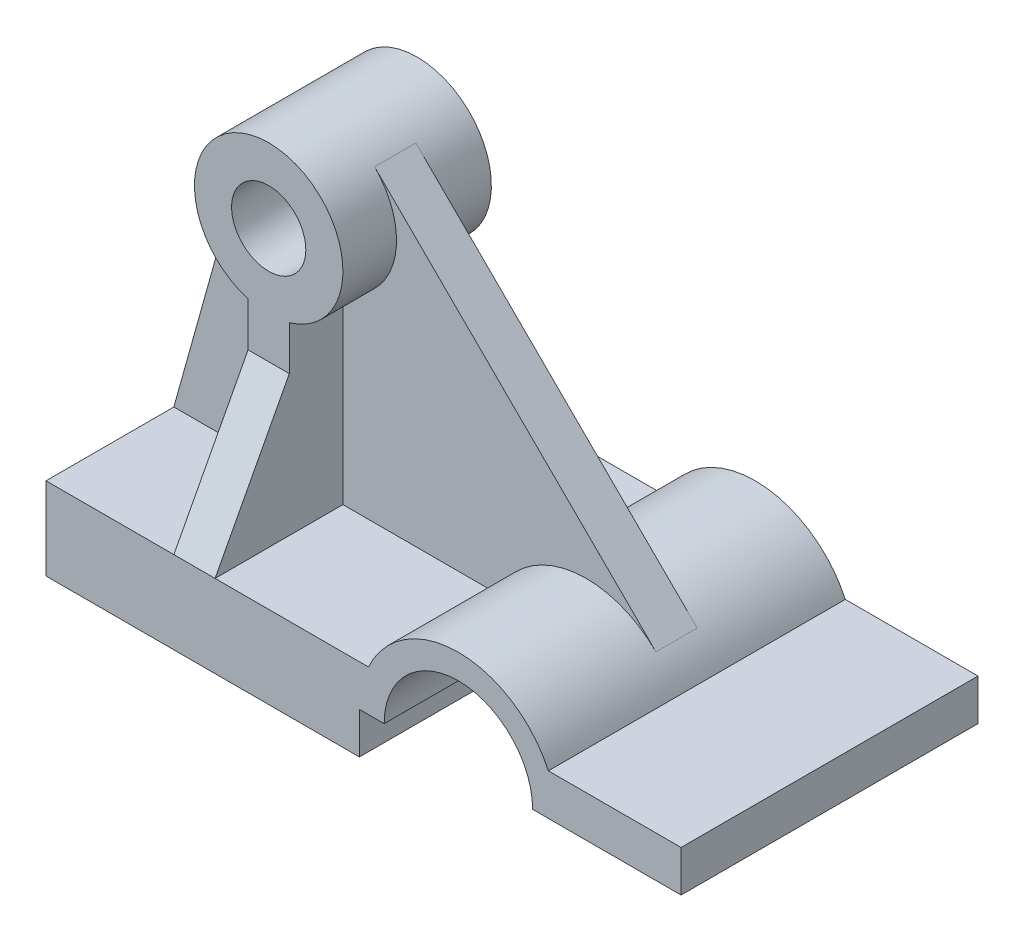
ISO-10303-21;
HEADER;
FILE_DESCRIPTION(('STEP AP214'),'2;1');
FILE_NAME('part.step','',(''),(''),'','','');
FILE_SCHEMA(('AUTOMOTIVE_DESIGN { 1 0 10303 214 1 1 1 1 }'));
ENDSEC;
DATA;
#1=APPLICATION_CONTEXT('core data for automotive mechanical design processes');
#2=APPLICATION_PROTOCOL_DEFINITION('international standard','automotive_design',2000,#1);
#3=PRODUCT_CONTEXT('',#1,'mechanical');
#4=PRODUCT('Part','Part','',(#3));
#5=PRODUCT_RELATED_PRODUCT_CATEGORY('part','',(#4));
#6=PRODUCT_DEFINITION_FORMATION('','',#4);
#7=PRODUCT_DEFINITION_CONTEXT('part definition',#1,'design');
#8=PRODUCT_DEFINITION('design','',#6,#7);
#9=PRODUCT_DEFINITION_SHAPE('','',#8);
#10=(LENGTH_UNIT() NAMED_UNIT(*) SI_UNIT(.MILLI.,.METRE.));
#11=(NAMED_UNIT(*) PLANE_ANGLE_UNIT() SI_UNIT($,.RADIAN.));
#12=(NAMED_UNIT(*) SI_UNIT($,.STERADIAN.) SOLID_ANGLE_UNIT());
#13=UNCERTAINTY_MEASURE_WITH_UNIT(LENGTH_MEASURE(1.E-05),#10,'distance_accuracy_value','');
#14=(GEOMETRIC_REPRESENTATION_CONTEXT(3) GLOBAL_UNCERTAINTY_ASSIGNED_CONTEXT((#13)) GLOBAL_UNIT_ASSIGNED_CONTEXT((#10,
#11,#12)) REPRESENTATION_CONTEXT('',''));
#15=CARTESIAN_POINT('',(0.,0.,0.));
#16=DIRECTION('',(0.,0.,1.));
#17=DIRECTION('',(1.,0.,0.));
#18=AXIS2_PLACEMENT_3D('',#15,#16,#17);
#19=CARTESIAN_POINT('',(36.9928651597961,18.1864951768489,-72.));
#20=DIRECTION('',(0.,1.,0.));
#21=DIRECTION('',(-1.,0.,0.));
#22=AXIS2_PLACEMENT_3D('',#19,#20,#21);
#23=PLANE('',#22);
#24=DIRECTION('',(0.,0.,1.));
#25=VECTOR('',#24,1.);
#26=CARTESIAN_POINT('',(-0.189710610932506,18.1864951768489,-98.));
#27=LINE('',#26,#25);
#28=CARTESIAN_POINT('',(-0.189710610932506,18.1864951768489,-31.));
#29=VERTEX_POINT('',#28);
#30=CARTESIAN_POINT('',(-0.189710610932495,18.1864951768489,0.));
#31=VERTEX_POINT('',#30);
#32=EDGE_CURVE('E81',#29,#31,#27,.T.);
#33=ORIENTED_EDGE('',*,*,#32,.T.);
#34=DIRECTION('',(-1.,0.,0.));
#35=VECTOR('',#34,1.);
#36=CARTESIAN_POINT('',(36.9928651597961,18.1864951768489,0.));
#37=LINE('',#36,#35);
#38=CARTESIAN_POINT('',(36.9928651597961,18.1864951768489,0.));
#39=VERTEX_POINT('',#38);
#40=EDGE_CURVE('E359',#39,#31,#37,.T.);
#41=ORIENTED_EDGE('',*,*,#40,.F.);
#42=DIRECTION('',(0.,0.,1.));
#43=VECTOR('',#42,1.);
#44=CARTESIAN_POINT('',(36.9928651597961,18.1864951768489,-72.));
#45=LINE('',#44,#43);
#46=CARTESIAN_POINT('',(36.9928651597961,18.1864951768489,-31.));
#47=VERTEX_POINT('',#46);
#48=EDGE_CURVE('E440',#47,#39,#45,.T.);
#49=ORIENTED_EDGE('',*,*,#48,.F.);
#50=DIRECTION('',(1.,0.,0.));
#51=VECTOR('',#50,1.);
#52=CARTESIAN_POINT('',(36.9928651597961,18.1864951768489,-31.));
#53=LINE('',#52,#51);
#54=EDGE_CURVE('E294',#29,#47,#53,.T.);
#55=ORIENTED_EDGE('',*,*,#54,.F.);
#56=EDGE_LOOP('',(#33,#41,#49,#55));
#57=FACE_BOUND('',#56,.T.);
#58=ADVANCED_FACE('F57',(#57),#23,.T.);
#59=DIRECTION('',(0.,0.,1.));
#60=VECTOR('',#59,1.);
#61=CARTESIAN_POINT('',(-10.1897106109325,18.1864951768489,-98.));
#62=LINE('',#61,#60);
#63=CARTESIAN_POINT('',(-10.1897106109325,18.1864951768489,-54.));
#64=VERTEX_POINT('',#63);
#65=CARTESIAN_POINT('',(-10.1897106109325,18.1864951768489,-41.));
#66=VERTEX_POINT('',#65);
#67=EDGE_CURVE('E317',#64,#66,#62,.T.);
#68=ORIENTED_EDGE('',*,*,#67,.F.);
#69=DIRECTION('',(-1.,0.,0.));
#70=VECTOR('',#69,1.);
#71=CARTESIAN_POINT('',(-23.1897106109325,18.1864951768489,-54.));
#72=LINE('',#71,#70);
#73=CARTESIAN_POINT('',(-0.189710610932506,18.1864951768489,-54.));
#74=VERTEX_POINT('',#73);
#75=EDGE_CURVE('E349',#74,#64,#72,.T.);
#76=ORIENTED_EDGE('',*,*,#75,.F.);
#77=CARTESIAN_POINT('',(-0.189710610932506,18.1864951768489,-41.));
#78=VERTEX_POINT('',#77);
#79=EDGE_CURVE('E310',#74,#78,#27,.T.);
#80=ORIENTED_EDGE('',*,*,#79,.T.);
#81=DIRECTION('',(1.,0.,0.));
#82=VECTOR('',#81,1.);
#83=CARTESIAN_POINT('',(36.9928651597961,18.1864951768489,-41.));
#84=LINE('',#83,#82);
#85=CARTESIAN_POINT('',(36.9928651597961,18.1864951768489,-41.));
#86=VERTEX_POINT('',#85);
#87=EDGE_CURVE('E280',#78,#86,#84,.T.);
#88=ORIENTED_EDGE('',*,*,#87,.T.);
#89=CARTESIAN_POINT('',(36.9928651597961,18.1864951768489,-72.));
#90=VERTEX_POINT('',#89);
#91=EDGE_CURVE('E436',#90,#86,#45,.T.);
#92=ORIENTED_EDGE('',*,*,#91,.F.);
#93=DIRECTION('',(-1.,0.,0.));
#94=VECTOR('',#93,1.);
#95=CARTESIAN_POINT('',(36.9928651597961,18.1864951768489,-72.));
#96=LINE('',#95,#94);
#97=CARTESIAN_POINT('',(-41.1897106109325,18.1864951768489,-72.));
#98=VERTEX_POINT('',#97);
#99=EDGE_CURVE('E390',#90,#98,#96,.T.);
#100=ORIENTED_EDGE('',*,*,#99,.T.);
#101=DIRECTION('',(0.,0.,1.));
#102=VECTOR('',#101,1.);
#103=CARTESIAN_POINT('',(-41.1897106109325,18.1864951768489,-72.));
#104=LINE('',#103,#102);
#105=CARTESIAN_POINT('',(-41.1897106109325,18.1864951768489,-41.));
#106=VERTEX_POINT('',#105);
#107=EDGE_CURVE('E431',#98,#106,#104,.T.);
#108=ORIENTED_EDGE('',*,*,#107,.T.);
#109=DIRECTION('',(1.,0.,0.));
#110=VECTOR('',#109,1.);
#111=CARTESIAN_POINT('',(36.9928651597961,18.1864951768489,-41.));
#112=LINE('',#111,#110);
#113=EDGE_CURVE('E237',#106,#66,#112,.T.);
#114=ORIENTED_EDGE('',*,*,#113,.T.);
#115=EDGE_LOOP('',(#68,#76,#80,#88,#92,#100,#108,#114));
#116=FACE_BOUND('',#115,.T.);
#117=ADVANCED_FACE('F521',(#116),#23,.T.);
#118=CARTESIAN_POINT('',(-10.1897106109325,0.,-98.));
#119=DIRECTION('',(-1.,0.,0.));
#120=DIRECTION('',(0.,0.,1.));
#121=AXIS2_PLACEMENT_3D('',#118,#119,#120);
#122=PLANE('',#121);
#123=ORIENTED_EDGE('',*,*,#67,.T.);
#124=DIRECTION('',(0.,1.,0.));
#125=VECTOR('',#124,1.);
#126=CARTESIAN_POINT('',(-10.1897106109325,0.,-41.));
#127=LINE('',#126,#125);
#128=CARTESIAN_POINT('',(-10.1897106109325,62.8948787110583,-41.));
#129=VERTEX_POINT('',#128);
#130=EDGE_CURVE('E247',#66,#129,#127,.T.);
#131=ORIENTED_EDGE('',*,*,#130,.T.);
#132=DIRECTION('',(0.,0.,1.));
#133=VECTOR('',#132,1.);
#134=CARTESIAN_POINT('',(-10.1897106109325,62.8948787110583,-98.));
#135=LINE('',#134,#133);
#136=CARTESIAN_POINT('',(-10.1897106109325,62.8948787110583,-54.));
#137=VERTEX_POINT('',#136);
#138=EDGE_CURVE('E244',#137,#129,#135,.T.);
#139=ORIENTED_EDGE('',*,*,#138,.F.);
#140=DIRECTION('',(0.,-1.,0.));
#141=VECTOR('',#140,1.);
#142=CARTESIAN_POINT('',(-10.1897106109325,98.1864951768489,-54.));
#143=LINE('',#142,#141);
#144=EDGE_CURVE('E335',#137,#64,#143,.T.);
#145=ORIENTED_EDGE('',*,*,#144,.T.);
#146=EDGE_LOOP('',(#123,#131,#139,#145));
#147=FACE_BOUND('',#146,.T.);
#148=ADVANCED_FACE('F525',(#147),#122,.T.);
#149=CARTESIAN_POINT('',(-0.189710610932506,0.,-98.));
#150=DIRECTION('',(1.,0.,0.));
#151=DIRECTION('',(0.,0.,-1.));
#152=AXIS2_PLACEMENT_3D('',#149,#150,#151);
#153=PLANE('',#152);
#154=DIRECTION('',(0.,0.,1.));
#155=VECTOR('',#154,1.);
#156=CARTESIAN_POINT('',(-0.189710610932506,62.8948787110583,-98.));
#157=LINE('',#156,#155);
#158=CARTESIAN_POINT('',(-0.189710610932506,62.8948787110583,-54.));
#159=VERTEX_POINT('',#158);
#160=CARTESIAN_POINT('',(-0.189710610932506,62.8948787110583,-41.));
#161=VERTEX_POINT('',#160);
#162=EDGE_CURVE('E328',#159,#161,#157,.T.);
#163=ORIENTED_EDGE('',*,*,#162,.T.);
#164=DIRECTION('',(0.,-1.,0.));
#165=VECTOR('',#164,1.);
#166=CARTESIAN_POINT('',(-0.189710610932506,0.,-41.));
#167=LINE('',#166,#165);
#168=EDGE_CURVE('E276',#161,#78,#167,.T.);
#169=ORIENTED_EDGE('',*,*,#168,.T.);
#170=ORIENTED_EDGE('',*,*,#79,.F.);
#171=DIRECTION('',(0.,1.,0.));
#172=VECTOR('',#171,1.);
#173=CARTESIAN_POINT('',(-0.189710610932505,98.1864951768489,-54.));
#174=LINE('',#173,#172);
#175=EDGE_CURVE('E315',#74,#159,#174,.T.);
#176=ORIENTED_EDGE('',*,*,#175,.T.);
#177=EDGE_LOOP('',(#163,#169,#170,#176));
#178=FACE_BOUND('',#177,.T.);
#179=ADVANCED_FACE('F531',(#178),#153,.T.);
#180=CARTESIAN_POINT('',(-23.1897106109325,98.1864951768489,-54.));
#181=DIRECTION('',(0.,0.,1.));
#182=DIRECTION('',(1.,0.,0.));
#183=AXIS2_PLACEMENT_3D('',#180,#181,#182);
#184=PLANE('',#183);
#185=CARTESIAN_POINT('',(-5.18971061093251,80.1864951768489,-54.));
#186=DIRECTION('',(0.,0.,1.));
#187=DIRECTION('',(1.,0.,0.));
#188=AXIS2_PLACEMENT_3D('',#185,#186,#187);
#189=CIRCLE('',#188,9.);
#190=CARTESIAN_POINT('',(3.81028938906749,80.1864951768489,-54.));
#191=VERTEX_POINT('',#190);
#192=EDGE_CURVE('E345',#191,#191,#189,.T.);
#193=ORIENTED_EDGE('',*,*,#192,.T.);
#194=EDGE_LOOP('',(#193));
#195=FACE_BOUND('',#194,.T.);
#196=ORIENTED_EDGE('',*,*,#144,.F.);
#197=CARTESIAN_POINT('',(-5.18971061093251,80.1864951768489,-54.));
#198=DIRECTION('',(0.,0.,1.));
#199=DIRECTION('',(1.,0.,0.));
#200=AXIS2_PLACEMENT_3D('',#197,#198,#199);
#201=CIRCLE('',#200,18.);
#202=EDGE_CURVE('E338',#159,#137,#201,.T.);
#203=ORIENTED_EDGE('',*,*,#202,.F.);
#204=ORIENTED_EDGE('',*,*,#175,.F.);
#205=ORIENTED_EDGE('',*,*,#75,.T.);
#206=EDGE_LOOP('',(#196,#203,#204,#205));
#207=FACE_BOUND('',#206,.T.);
#208=ADVANCED_FACE('F528',(#195,#207),#184,.F.);
#209=CARTESIAN_POINT('',(-23.1897106109325,98.1864951768489,-18.));
#210=DIRECTION('',(0.,0.,-1.));
#211=DIRECTION('',(-1.,0.,0.));
#212=AXIS2_PLACEMENT_3D('',#209,#210,#211);
#213=PLANE('',#212);
#214=CARTESIAN_POINT('',(-5.18971061093251,80.1864951768489,-18.));
#215=DIRECTION('',(0.,0.,1.));
#216=DIRECTION('',(1.,0.,0.));
#217=AXIS2_PLACEMENT_3D('',#214,#215,#216);
#218=CIRCLE('',#217,9.);
#219=CARTESIAN_POINT('',(3.81028938906749,80.1864951768489,-18.));
#220=VERTEX_POINT('',#219);
#221=EDGE_CURVE('E341',#220,#220,#218,.T.);
#222=ORIENTED_EDGE('',*,*,#221,.F.);
#223=EDGE_LOOP('',(#222));
#224=FACE_BOUND('',#223,.T.);
#225=DIRECTION('',(0.,-1.,0.));
#226=VECTOR('',#225,1.);
#227=CARTESIAN_POINT('',(-10.1897106109325,0.,-18.));
#228=LINE('',#227,#226);
#229=CARTESIAN_POINT('',(-10.1897106109325,62.8948787110583,-18.));
#230=VERTEX_POINT('',#229);
#231=CARTESIAN_POINT('',(-10.1897106109325,52.1864951768489,-18.));
#232=VERTEX_POINT('',#231);
#233=EDGE_CURVE('E309',#230,#232,#228,.T.);
#234=ORIENTED_EDGE('',*,*,#233,.T.);
#235=DIRECTION('',(-1.,0.,0.));
#236=VECTOR('',#235,1.);
#237=CARTESIAN_POINT('',(-23.1897106109325,52.1864951768489,-18.));
#238=LINE('',#237,#236);
#239=CARTESIAN_POINT('',(-0.189710610932499,52.1864951768489,-18.));
#240=VERTEX_POINT('',#239);
#241=EDGE_CURVE('E239',#232,#240,#238,.F.);
#242=ORIENTED_EDGE('',*,*,#241,.T.);
#243=DIRECTION('',(0.,1.,0.));
#244=VECTOR('',#243,1.);
#245=CARTESIAN_POINT('',(-0.189710610932506,0.,-18.));
#246=LINE('',#245,#244);
#247=CARTESIAN_POINT('',(-0.189710610932505,62.8948787110583,-18.));
#248=VERTEX_POINT('',#247);
#249=EDGE_CURVE('E304',#240,#248,#246,.T.);
#250=ORIENTED_EDGE('',*,*,#249,.T.);
#251=CARTESIAN_POINT('',(-5.18971061093251,80.1864951768489,-18.));
#252=DIRECTION('',(0.,0.,1.));
#253=DIRECTION('',(1.,0.,0.));
#254=AXIS2_PLACEMENT_3D('',#251,#252,#253);
#255=CIRCLE('',#254,18.);
#256=EDGE_CURVE('E305',#248,#230,#255,.T.);
#257=ORIENTED_EDGE('',*,*,#256,.T.);
#258=EDGE_LOOP('',(#234,#242,#250,#257));
#259=FACE_BOUND('',#258,.T.);
#260=ADVANCED_FACE('F574',(#224,#259),#213,.F.);
#261=CARTESIAN_POINT('',(-10.1897106109325,18.1864951768489,0.));
#262=VERTEX_POINT('',#261);
#263=CARTESIAN_POINT('',(-41.1897106109325,18.1864951768489,0.));
#264=VERTEX_POINT('',#263);
#265=EDGE_CURVE('E428',#262,#264,#37,.T.);
#266=ORIENTED_EDGE('',*,*,#265,.F.);
#267=CARTESIAN_POINT('',(-10.1897106109325,18.1864951768489,-31.));
#268=VERTEX_POINT('',#267);
#269=EDGE_CURVE('E73',#268,#262,#62,.T.);
#270=ORIENTED_EDGE('',*,*,#269,.F.);
#271=DIRECTION('',(1.,0.,0.));
#272=VECTOR('',#271,1.);
#273=CARTESIAN_POINT('',(36.9928651597961,18.1864951768489,-31.));
#274=LINE('',#273,#272);
#275=CARTESIAN_POINT('',(-41.1897106109325,18.1864951768489,-31.));
#276=VERTEX_POINT('',#275);
#277=EDGE_CURVE('E258',#276,#268,#274,.T.);
#278=ORIENTED_EDGE('',*,*,#277,.F.);
#279=EDGE_CURVE('E435',#276,#264,#104,.T.);
#280=ORIENTED_EDGE('',*,*,#279,.T.);
#281=EDGE_LOOP('',(#266,#270,#278,#280));
#282=FACE_BOUND('',#281,.T.);
#283=ADVANCED_FACE('F491',(#282),#23,.T.);
#284=CARTESIAN_POINT('',(-41.1897106109325,18.1864951768489,-72.));
#285=DIRECTION('',(-1.,0.,0.));
#286=DIRECTION('',(0.,0.,1.));
#287=AXIS2_PLACEMENT_3D('',#284,#285,#286);
#288=PLANE('',#287);
#289=ORIENTED_EDGE('',*,*,#279,.F.);
#290=DIRECTION('',(0.,0.,-1.));
#291=VECTOR('',#290,1.);
#292=CARTESIAN_POINT('',(-41.1897106109325,18.1864951768489,-72.));
#293=LINE('',#292,#291);
#294=EDGE_CURVE('E261',#276,#106,#293,.T.);
#295=ORIENTED_EDGE('',*,*,#294,.T.);
#296=ORIENTED_EDGE('',*,*,#107,.F.);
#297=DIRECTION('',(0.,-1.,0.));
#298=VECTOR('',#297,1.);
#299=CARTESIAN_POINT('',(-41.1897106109325,18.1864951768489,-72.));
#300=LINE('',#299,#298);
#301=CARTESIAN_POINT('',(-41.1897106109325,-1.81350482315113,-72.));
#302=VERTEX_POINT('',#301);
#303=EDGE_CURVE('E354',#98,#302,#300,.T.);
#304=ORIENTED_EDGE('',*,*,#303,.T.);
#305=DIRECTION('',(0.,0.,1.));
#306=VECTOR('',#305,1.);
#307=CARTESIAN_POINT('',(-41.1897106109325,-1.81350482315113,-72.));
#308=LINE('',#307,#306);
#309=CARTESIAN_POINT('',(-41.1897106109325,-1.81350482315113,0.));
#310=VERTEX_POINT('',#309);
#311=EDGE_CURVE('E393',#302,#310,#308,.T.);
#312=ORIENTED_EDGE('',*,*,#311,.T.);
#313=DIRECTION('',(0.,-1.,0.));
#314=VECTOR('',#313,1.);
#315=CARTESIAN_POINT('',(-41.1897106109325,18.1864951768489,0.));
#316=LINE('',#315,#314);
#317=EDGE_CURVE('E353',#264,#310,#316,.T.);
#318=ORIENTED_EDGE('',*,*,#317,.F.);
#319=EDGE_LOOP('',(#289,#295,#296,#304,#312,#318));
#320=FACE_BOUND('',#319,.T.);
#321=ADVANCED_FACE('F59',(#320),#288,.T.);
#322=CARTESIAN_POINT('',(58.8102893890675,8.18649517684887,-72.));
#323=DIRECTION('',(0.,0.,1.));
#324=DIRECTION('',(1.,0.,0.));
#325=AXIS2_PLACEMENT_3D('',#322,#323,#324);
#326=CYLINDRICAL_SURFACE('',#325,24.);
#327=CARTESIAN_POINT('',(58.8102893890675,8.18649517684887,0.));
#328=DIRECTION('',(0.,0.,1.));
#329=DIRECTION('',(1.,0.,0.));
#330=AXIS2_PLACEMENT_3D('',#327,#328,#329);
#331=CIRCLE('',#330,24.);
#332=CARTESIAN_POINT('',(80.6277136183389,18.1864951768489,0.));
#333=VERTEX_POINT('',#332);
#334=EDGE_CURVE('E424',#333,#39,#331,.T.);
#335=ORIENTED_EDGE('',*,*,#334,.F.);
#336=DIRECTION('',(0.,0.,1.));
#337=VECTOR('',#336,1.);
#338=CARTESIAN_POINT('',(80.6277136183389,18.1864951768489,-72.));
#339=LINE('',#338,#337);
#340=CARTESIAN_POINT('',(80.6277136183389,18.1864951768489,-72.));
#341=VERTEX_POINT('',#340);
#342=EDGE_CURVE('E441',#341,#333,#339,.T.);
#343=ORIENTED_EDGE('',*,*,#342,.F.);
#344=CARTESIAN_POINT('',(58.8102893890675,8.18649517684887,-72.));
#345=DIRECTION('',(0.,0.,1.));
#346=DIRECTION('',(1.,0.,0.));
#347=AXIS2_PLACEMENT_3D('',#344,#345,#346);
#348=CIRCLE('',#347,24.);
#349=EDGE_CURVE('E386',#341,#90,#348,.T.);
#350=ORIENTED_EDGE('',*,*,#349,.T.);
#351=ORIENTED_EDGE('',*,*,#91,.T.);
#352=CARTESIAN_POINT('',(58.8102893890675,8.18649517684887,-41.));
#353=DIRECTION('',(0.,0.,1.));
#354=DIRECTION('',(1.,0.,0.));
#355=AXIS2_PLACEMENT_3D('',#352,#353,#354);
#356=CIRCLE('',#355,24.);
#357=CARTESIAN_POINT('',(75.7201825877705,25.2175113534738,-41.));
#358=VERTEX_POINT('',#357);
#359=EDGE_CURVE('E284',#86,#358,#356,.F.);
#360=ORIENTED_EDGE('',*,*,#359,.T.);
#361=DIRECTION('',(0.,0.,1.));
#362=VECTOR('',#361,1.);
#363=CARTESIAN_POINT('',(75.7201825877705,25.2175113534738,-72.));
#364=LINE('',#363,#362);
#365=CARTESIAN_POINT('',(75.7201825877705,25.2175113534738,-31.));
#366=VERTEX_POINT('',#365);
#367=EDGE_CURVE('E300',#358,#366,#364,.T.);
#368=ORIENTED_EDGE('',*,*,#367,.T.);
#369=CARTESIAN_POINT('',(58.8102893890675,8.18649517684887,-31.));
#370=DIRECTION('',(0.,0.,1.));
#371=DIRECTION('',(1.,0.,0.));
#372=AXIS2_PLACEMENT_3D('',#369,#370,#371);
#373=CIRCLE('',#372,24.);
#374=EDGE_CURVE('E297',#47,#366,#373,.F.);
#375=ORIENTED_EDGE('',*,*,#374,.F.);
#376=ORIENTED_EDGE('',*,*,#48,.T.);
#377=EDGE_LOOP('',(#335,#343,#350,#351,#360,#368,#375,#376));
#378=FACE_BOUND('',#377,.T.);
#379=ADVANCED_FACE('F537',(#378),#326,.T.);
#380=CARTESIAN_POINT('',(112.810289389068,18.1864951768489,-72.));
#381=DIRECTION('',(0.,1.,0.));
#382=DIRECTION('',(-1.,0.,0.));
#383=AXIS2_PLACEMENT_3D('',#380,#381,#382);
#384=PLANE('',#383);
#385=DIRECTION('',(-1.,0.,0.));
#386=VECTOR('',#385,1.);
#387=CARTESIAN_POINT('',(112.810289389068,18.1864951768489,0.));
#388=LINE('',#387,#386);
#389=CARTESIAN_POINT('',(112.810289389068,18.1864951768489,0.));
#390=VERTEX_POINT('',#389);
#391=EDGE_CURVE('E420',#390,#333,#388,.T.);
#392=ORIENTED_EDGE('',*,*,#391,.F.);
#393=DIRECTION('',(0.,0.,1.));
#394=VECTOR('',#393,1.);
#395=CARTESIAN_POINT('',(112.810289389068,18.1864951768489,-72.));
#396=LINE('',#395,#394);
#397=CARTESIAN_POINT('',(112.810289389068,18.1864951768489,-72.));
#398=VERTEX_POINT('',#397);
#399=EDGE_CURVE('E444',#398,#390,#396,.T.);
#400=ORIENTED_EDGE('',*,*,#399,.F.);
#401=DIRECTION('',(-1.,0.,0.));
#402=VECTOR('',#401,1.);
#403=CARTESIAN_POINT('',(112.810289389068,18.1864951768489,-72.));
#404=LINE('',#403,#402);
#405=EDGE_CURVE('E382',#398,#341,#404,.T.);
#406=ORIENTED_EDGE('',*,*,#405,.T.);
#407=ORIENTED_EDGE('',*,*,#342,.T.);
#408=EDGE_LOOP('',(#392,#400,#406,#407));
#409=FACE_BOUND('',#408,.T.);
#410=ADVANCED_FACE('F570',(#409),#384,.T.);
#411=CARTESIAN_POINT('',(112.810289389068,8.18649517684887,-72.));
#412=DIRECTION('',(1.,0.,0.));
#413=DIRECTION('',(0.,0.,-1.));
#414=AXIS2_PLACEMENT_3D('',#411,#412,#413);
#415=PLANE('',#414);
#416=DIRECTION('',(0.,1.,0.));
#417=VECTOR('',#416,1.);
#418=CARTESIAN_POINT('',(112.810289389068,8.18649517684887,0.));
#419=LINE('',#418,#417);
#420=CARTESIAN_POINT('',(112.810289389068,8.18649517684887,0.));
#421=VERTEX_POINT('',#420);
#422=EDGE_CURVE('E416',#421,#390,#419,.T.);
#423=ORIENTED_EDGE('',*,*,#422,.F.);
#424=DIRECTION('',(0.,0.,1.));
#425=VECTOR('',#424,1.);
#426=CARTESIAN_POINT('',(112.810289389068,8.18649517684887,-72.));
#427=LINE('',#426,#425);
#428=CARTESIAN_POINT('',(112.810289389068,8.18649517684887,-72.));
#429=VERTEX_POINT('',#428);
#430=EDGE_CURVE('E447',#429,#421,#427,.T.);
#431=ORIENTED_EDGE('',*,*,#430,.F.);
#432=DIRECTION('',(0.,1.,0.));
#433=VECTOR('',#432,1.);
#434=CARTESIAN_POINT('',(112.810289389068,8.18649517684887,-72.));
#435=LINE('',#434,#433);
#436=EDGE_CURVE('E378',#429,#398,#435,.T.);
#437=ORIENTED_EDGE('',*,*,#436,.T.);
#438=ORIENTED_EDGE('',*,*,#399,.T.);
#439=EDGE_LOOP('',(#423,#431,#437,#438));
#440=FACE_BOUND('',#439,.T.);
#441=ADVANCED_FACE('F566',(#440),#415,.T.);
#442=CARTESIAN_POINT('',(76.8102893890675,8.18649517684887,-72.));
#443=DIRECTION('',(0.,-1.,0.));
#444=DIRECTION('',(0.,0.,-1.));
#445=AXIS2_PLACEMENT_3D('',#442,#443,#444);
#446=PLANE('',#445);
#447=DIRECTION('',(1.,0.,0.));
#448=VECTOR('',#447,1.);
#449=CARTESIAN_POINT('',(76.8102893890675,8.18649517684887,0.));
#450=LINE('',#449,#448);
#451=CARTESIAN_POINT('',(76.8102893890675,8.18649517684887,0.));
#452=VERTEX_POINT('',#451);
#453=EDGE_CURVE('E412',#452,#421,#450,.T.);
#454=ORIENTED_EDGE('',*,*,#453,.F.);
#455=DIRECTION('',(0.,0.,1.));
#456=VECTOR('',#455,1.);
#457=CARTESIAN_POINT('',(76.8102893890675,8.18649517684887,-72.));
#458=LINE('',#457,#456);
#459=CARTESIAN_POINT('',(76.8102893890675,8.18649517684887,-72.));
#460=VERTEX_POINT('',#459);
#461=EDGE_CURVE('E450',#460,#452,#458,.T.);
#462=ORIENTED_EDGE('',*,*,#461,.F.);
#463=DIRECTION('',(1.,0.,0.));
#464=VECTOR('',#463,1.);
#465=CARTESIAN_POINT('',(76.8102893890675,8.18649517684887,-72.));
#466=LINE('',#465,#464);
#467=EDGE_CURVE('E374',#460,#429,#466,.T.);
#468=ORIENTED_EDGE('',*,*,#467,.T.);
#469=ORIENTED_EDGE('',*,*,#430,.T.);
#470=EDGE_LOOP('',(#454,#462,#468,#469));
#471=FACE_BOUND('',#470,.T.);
#472=ADVANCED_FACE('F562',(#471),#446,.T.);
#473=CARTESIAN_POINT('',(58.8102893890675,8.18649517684887,-72.));
#474=DIRECTION('',(0.,0.,1.));
#475=DIRECTION('',(1.,0.,0.));
#476=AXIS2_PLACEMENT_3D('',#473,#474,#475);
#477=CYLINDRICAL_SURFACE('',#476,18.);
#478=CARTESIAN_POINT('',(58.8102893890675,8.18649517684887,0.));
#479=DIRECTION('',(0.,0.,-1.));
#480=DIRECTION('',(-1.,0.,0.));
#481=AXIS2_PLACEMENT_3D('',#478,#479,#480);
#482=CIRCLE('',#481,18.);
#483=CARTESIAN_POINT('',(40.8102893890675,8.18649517684887,0.));
#484=VERTEX_POINT('',#483);
#485=EDGE_CURVE('E408',#484,#452,#482,.T.);
#486=ORIENTED_EDGE('',*,*,#485,.F.);
#487=DIRECTION('',(0.,0.,1.));
#488=VECTOR('',#487,1.);
#489=CARTESIAN_POINT('',(40.8102893890675,8.18649517684887,-72.));
#490=LINE('',#489,#488);
#491=CARTESIAN_POINT('',(40.8102893890675,8.18649517684887,-72.));
#492=VERTEX_POINT('',#491);
#493=EDGE_CURVE('E453',#492,#484,#490,.T.);
#494=ORIENTED_EDGE('',*,*,#493,.F.);
#495=CARTESIAN_POINT('',(58.8102893890675,8.18649517684887,-72.));
#496=DIRECTION('',(0.,0.,-1.));
#497=DIRECTION('',(-1.,0.,0.));
#498=AXIS2_PLACEMENT_3D('',#495,#496,#497);
#499=CIRCLE('',#498,18.);
#500=EDGE_CURVE('E370',#492,#460,#499,.T.);
#501=ORIENTED_EDGE('',*,*,#500,.T.);
#502=ORIENTED_EDGE('',*,*,#461,.T.);
#503=EDGE_LOOP('',(#486,#494,#501,#502));
#504=FACE_BOUND('',#503,.T.);
#505=ADVANCED_FACE('F558',(#504),#477,.F.);
#506=CARTESIAN_POINT('',(34.8102893890675,8.18649517684887,-72.));
#507=DIRECTION('',(0.,-1.,0.));
#508=DIRECTION('',(1.,0.,0.));
#509=AXIS2_PLACEMENT_3D('',#506,#507,#508);
#510=PLANE('',#509);
#511=DIRECTION('',(1.,0.,0.));
#512=VECTOR('',#511,1.);
#513=CARTESIAN_POINT('',(34.8102893890675,8.18649517684887,0.));
#514=LINE('',#513,#512);
#515=CARTESIAN_POINT('',(34.8102893890675,8.18649517684887,0.));
#516=VERTEX_POINT('',#515);
#517=EDGE_CURVE('E404',#516,#484,#514,.T.);
#518=ORIENTED_EDGE('',*,*,#517,.F.);
#519=DIRECTION('',(0.,0.,1.));
#520=VECTOR('',#519,1.);
#521=CARTESIAN_POINT('',(34.8102893890675,8.18649517684887,-72.));
#522=LINE('',#521,#520);
#523=CARTESIAN_POINT('',(34.8102893890675,8.18649517684887,-72.));
#524=VERTEX_POINT('',#523);
#525=EDGE_CURVE('E456',#524,#516,#522,.T.);
#526=ORIENTED_EDGE('',*,*,#525,.F.);
#527=DIRECTION('',(1.,0.,0.));
#528=VECTOR('',#527,1.);
#529=CARTESIAN_POINT('',(34.8102893890675,8.18649517684887,-72.));
#530=LINE('',#529,#528);
#531=EDGE_CURVE('E366',#524,#492,#530,.T.);
#532=ORIENTED_EDGE('',*,*,#531,.T.);
#533=ORIENTED_EDGE('',*,*,#493,.T.);
#534=EDGE_LOOP('',(#518,#526,#532,#533));
#535=FACE_BOUND('',#534,.T.);
#536=ADVANCED_FACE('F555',(#535),#510,.T.);
#537=CARTESIAN_POINT('',(34.8102893890675,-1.81350482315113,-72.));
#538=DIRECTION('',(1.,0.,0.));
#539=DIRECTION('',(0.,0.,-1.));
#540=AXIS2_PLACEMENT_3D('',#537,#538,#539);
#541=PLANE('',#540);
#542=DIRECTION('',(0.,1.,0.));
#543=VECTOR('',#542,1.);
#544=CARTESIAN_POINT('',(34.8102893890675,-1.81350482315113,0.));
#545=LINE('',#544,#543);
#546=CARTESIAN_POINT('',(34.8102893890675,-1.81350482315113,0.));
#547=VERTEX_POINT('',#546);
#548=EDGE_CURVE('E400',#547,#516,#545,.T.);
#549=ORIENTED_EDGE('',*,*,#548,.F.);
#550=DIRECTION('',(0.,0.,1.));
#551=VECTOR('',#550,1.);
#552=CARTESIAN_POINT('',(34.8102893890675,-1.81350482315113,-72.));
#553=LINE('',#552,#551);
#554=CARTESIAN_POINT('',(34.8102893890675,-1.81350482315113,-72.));
#555=VERTEX_POINT('',#554);
#556=EDGE_CURVE('E459',#555,#547,#553,.T.);
#557=ORIENTED_EDGE('',*,*,#556,.F.);
#558=DIRECTION('',(0.,1.,0.));
#559=VECTOR('',#558,1.);
#560=CARTESIAN_POINT('',(34.8102893890675,-1.81350482315113,-72.));
#561=LINE('',#560,#559);
#562=EDGE_CURVE('E362',#555,#524,#561,.T.);
#563=ORIENTED_EDGE('',*,*,#562,.T.);
#564=ORIENTED_EDGE('',*,*,#525,.T.);
#565=EDGE_LOOP('',(#549,#557,#563,#564));
#566=FACE_BOUND('',#565,.T.);
#567=ADVANCED_FACE('F551',(#566),#541,.T.);
#568=CARTESIAN_POINT('',(-41.1897106109325,-1.81350482315113,-72.));
#569=DIRECTION('',(0.,-1.,0.));
#570=DIRECTION('',(0.,0.,-1.));
#571=AXIS2_PLACEMENT_3D('',#568,#569,#570);
#572=PLANE('',#571);
#573=DIRECTION('',(1.,0.,0.));
#574=VECTOR('',#573,1.);
#575=CARTESIAN_POINT('',(-41.1897106109325,-1.81350482315113,-72.));
#576=LINE('',#575,#574);
#577=EDGE_CURVE('E358',#302,#555,#576,.T.);
#578=ORIENTED_EDGE('',*,*,#577,.T.);
#579=ORIENTED_EDGE('',*,*,#556,.T.);
#580=DIRECTION('',(1.,0.,0.));
#581=VECTOR('',#580,1.);
#582=CARTESIAN_POINT('',(-41.1897106109325,-1.81350482315113,0.));
#583=LINE('',#582,#581);
#584=EDGE_CURVE('E397',#310,#547,#583,.T.);
#585=ORIENTED_EDGE('',*,*,#584,.F.);
#586=ORIENTED_EDGE('',*,*,#311,.F.);
#587=EDGE_LOOP('',(#578,#579,#585,#586));
#588=FACE_BOUND('',#587,.T.);
#589=ADVANCED_FACE('F548',(#588),#572,.T.);
#590=CARTESIAN_POINT('',(58.8102893890675,8.18649517684887,-72.));
#591=DIRECTION('',(0.,0.,-1.));
#592=DIRECTION('',(-1.,0.,0.));
#593=AXIS2_PLACEMENT_3D('',#590,#591,#592);
#594=PLANE('',#593);
#595=ORIENTED_EDGE('',*,*,#303,.F.);
#596=ORIENTED_EDGE('',*,*,#99,.F.);
#597=ORIENTED_EDGE('',*,*,#349,.F.);
#598=ORIENTED_EDGE('',*,*,#405,.F.);
#599=ORIENTED_EDGE('',*,*,#436,.F.);
#600=ORIENTED_EDGE('',*,*,#467,.F.);
#601=ORIENTED_EDGE('',*,*,#500,.F.);
#602=ORIENTED_EDGE('',*,*,#531,.F.);
#603=ORIENTED_EDGE('',*,*,#562,.F.);
#604=ORIENTED_EDGE('',*,*,#577,.F.);
#605=EDGE_LOOP('',(#595,#596,#597,#598,#599,#600,#601,#602,#603,#604));
#606=FACE_BOUND('',#605,.T.);
#607=ADVANCED_FACE('F543',(#606),#594,.T.);
#608=CARTESIAN_POINT('',(58.8102893890675,8.18649517684887,0.));
#609=DIRECTION('',(0.,0.,-1.));
#610=DIRECTION('',(-1.,0.,0.));
#611=AXIS2_PLACEMENT_3D('',#608,#609,#610);
#612=PLANE('',#611);
#613=ORIENTED_EDGE('',*,*,#584,.T.);
#614=ORIENTED_EDGE('',*,*,#548,.T.);
#615=ORIENTED_EDGE('',*,*,#517,.T.);
#616=ORIENTED_EDGE('',*,*,#485,.T.);
#617=ORIENTED_EDGE('',*,*,#453,.T.);
#618=ORIENTED_EDGE('',*,*,#422,.T.);
#619=ORIENTED_EDGE('',*,*,#391,.T.);
#620=ORIENTED_EDGE('',*,*,#334,.T.);
#621=ORIENTED_EDGE('',*,*,#40,.T.);
#622=DIRECTION('',(-1.,0.,0.));
#623=VECTOR('',#622,1.);
#624=CARTESIAN_POINT('',(58.8102893890675,18.1864951768489,0.));
#625=LINE('',#624,#623);
#626=EDGE_CURVE('E498',#262,#31,#625,.F.);
#627=ORIENTED_EDGE('',*,*,#626,.F.);
#628=ORIENTED_EDGE('',*,*,#265,.T.);
#629=ORIENTED_EDGE('',*,*,#317,.T.);
#630=EDGE_LOOP('',(#613,#614,#615,#616,#617,#618,#619,#620,#621,#627,#628,#629));
#631=FACE_BOUND('',#630,.T.);
#632=ADVANCED_FACE('F496',(#631),#612,.F.);
#633=CARTESIAN_POINT('',(-5.18971061093251,80.1864951768489,-98.));
#634=DIRECTION('',(0.,0.,1.));
#635=DIRECTION('',(1.,0.,0.));
#636=AXIS2_PLACEMENT_3D('',#633,#634,#635);
#637=CYLINDRICAL_SURFACE('',#636,9.);
#638=ORIENTED_EDGE('',*,*,#192,.F.);
#639=EDGE_LOOP('',(#638));
#640=FACE_BOUND('',#639,.T.);
#641=ORIENTED_EDGE('',*,*,#221,.T.);
#642=EDGE_LOOP('',(#641));
#643=FACE_BOUND('',#642,.T.);
#644=ADVANCED_FACE('F609',(#640,#643),#637,.F.);
#645=ORIENTED_EDGE('',*,*,#249,.F.);
#646=DIRECTION('',(0.,-0.883787916347062,0.467887720419033));
#647=VECTOR('',#646,1.);
#648=CARTESIAN_POINT('',(-0.189710610932492,52.1864951768489,-18.));
#649=LINE('',#648,#647);
#650=EDGE_CURVE('E510',#240,#31,#649,.T.);
#651=ORIENTED_EDGE('',*,*,#650,.T.);
#652=ORIENTED_EDGE('',*,*,#32,.F.);
#653=DIRECTION('',(0.,-1.,0.));
#654=VECTOR('',#653,1.);
#655=CARTESIAN_POINT('',(-0.189710610932506,0.,-31.));
#656=LINE('',#655,#654);
#657=CARTESIAN_POINT('',(-0.189710610932507,62.8948787110583,-31.));
#658=VERTEX_POINT('',#657);
#659=EDGE_CURVE('E291',#658,#29,#656,.T.);
#660=ORIENTED_EDGE('',*,*,#659,.F.);
#661=EDGE_CURVE('E324',#658,#248,#157,.T.);
#662=ORIENTED_EDGE('',*,*,#661,.T.);
#663=EDGE_LOOP('',(#645,#651,#652,#660,#662));
#664=FACE_BOUND('',#663,.T.);
#665=ADVANCED_FACE('F572',(#664),#153,.T.);
#666=CARTESIAN_POINT('',(-5.18971061093251,80.1864951768489,-98.));
#667=DIRECTION('',(0.,0.,1.));
#668=DIRECTION('',(1.,0.,0.));
#669=AXIS2_PLACEMENT_3D('',#666,#667,#668);
#670=CYLINDRICAL_SURFACE('',#669,18.);
#671=ORIENTED_EDGE('',*,*,#202,.T.);
#672=ORIENTED_EDGE('',*,*,#138,.T.);
#673=CARTESIAN_POINT('',(-5.18971061093251,80.1864951768489,-41.));
#674=DIRECTION('',(0.,0.,1.));
#675=DIRECTION('',(1.,0.,0.));
#676=AXIS2_PLACEMENT_3D('',#673,#674,#675);
#677=CIRCLE('',#676,18.);
#678=CARTESIAN_POINT('',(-22.5265793699625,85.0272576820921,-41.));
#679=VERTEX_POINT('',#678);
#680=EDGE_CURVE('E234',#129,#679,#677,.F.);
#681=ORIENTED_EDGE('',*,*,#680,.T.);
#682=DIRECTION('',(0.,0.,1.));
#683=VECTOR('',#682,1.);
#684=CARTESIAN_POINT('',(-22.5265793699625,85.0272576820921,-98.));
#685=LINE('',#684,#683);
#686=CARTESIAN_POINT('',(-22.5265793699625,85.0272576820921,-31.));
#687=VERTEX_POINT('',#686);
#688=EDGE_CURVE('E12',#687,#679,#685,.F.);
#689=ORIENTED_EDGE('',*,*,#688,.F.);
#690=CARTESIAN_POINT('',(-5.18971061093251,80.1864951768489,-31.));
#691=DIRECTION('',(0.,0.,1.));
#692=DIRECTION('',(1.,0.,0.));
#693=AXIS2_PLACEMENT_3D('',#690,#691,#692);
#694=CIRCLE('',#693,18.);
#695=CARTESIAN_POINT('',(-10.1897106109325,62.8948787110583,-31.));
#696=VERTEX_POINT('',#695);
#697=EDGE_CURVE('E246',#696,#687,#694,.F.);
#698=ORIENTED_EDGE('',*,*,#697,.F.);
#699=EDGE_CURVE('E316',#696,#230,#135,.T.);
#700=ORIENTED_EDGE('',*,*,#699,.T.);
#701=ORIENTED_EDGE('',*,*,#256,.F.);
#702=ORIENTED_EDGE('',*,*,#661,.F.);
#703=CARTESIAN_POINT('',(-5.18971061093251,80.1864951768489,-31.));
#704=DIRECTION('',(0.,0.,1.));
#705=DIRECTION('',(1.,0.,0.));
#706=AXIS2_PLACEMENT_3D('',#703,#704,#705);
#707=CIRCLE('',#706,18.);
#708=CARTESIAN_POINT('',(7.49270928809474,92.9597573093175,-31.));
#709=VERTEX_POINT('',#708);
#710=EDGE_CURVE('E288',#709,#658,#707,.F.);
#711=ORIENTED_EDGE('',*,*,#710,.F.);
#712=DIRECTION('',(0.,0.,1.));
#713=VECTOR('',#712,1.);
#714=CARTESIAN_POINT('',(7.49270928809474,92.9597573093175,-98.));
#715=LINE('',#714,#713);
#716=CARTESIAN_POINT('',(7.49270928809474,92.9597573093175,-41.));
#717=VERTEX_POINT('',#716);
#718=EDGE_CURVE('E66',#717,#709,#715,.T.);
#719=ORIENTED_EDGE('',*,*,#718,.F.);
#720=CARTESIAN_POINT('',(-5.18971061093251,80.1864951768489,-41.));
#721=DIRECTION('',(0.,0.,1.));
#722=DIRECTION('',(1.,0.,0.));
#723=AXIS2_PLACEMENT_3D('',#720,#721,#722);
#724=CIRCLE('',#723,18.);
#725=EDGE_CURVE('E269',#717,#161,#724,.F.);
#726=ORIENTED_EDGE('',*,*,#725,.T.);
#727=ORIENTED_EDGE('',*,*,#162,.F.);
#728=EDGE_LOOP('',(#671,#672,#681,#689,#698,#700,#701,#702,#711,#719,#726,#727));
#729=FACE_BOUND('',#728,.T.);
#730=ADVANCED_FACE('F242',(#729),#670,.T.);
#731=ORIENTED_EDGE('',*,*,#269,.T.);
#732=DIRECTION('',(0.,-0.883787916347062,0.467887720419033));
#733=VECTOR('',#732,1.);
#734=CARTESIAN_POINT('',(-10.1897106109325,52.1864951768489,-18.));
#735=LINE('',#734,#733);
#736=EDGE_CURVE('E504',#232,#262,#735,.T.);
#737=ORIENTED_EDGE('',*,*,#736,.F.);
#738=ORIENTED_EDGE('',*,*,#233,.F.);
#739=ORIENTED_EDGE('',*,*,#699,.F.);
#740=DIRECTION('',(0.,1.,0.));
#741=VECTOR('',#740,1.);
#742=CARTESIAN_POINT('',(-10.1897106109325,0.,-31.));
#743=LINE('',#742,#741);
#744=EDGE_CURVE('E251',#268,#696,#743,.T.);
#745=ORIENTED_EDGE('',*,*,#744,.F.);
#746=EDGE_LOOP('',(#731,#737,#738,#739,#745));
#747=FACE_BOUND('',#746,.T.);
#748=ADVANCED_FACE('F576',(#747),#122,.T.);
#749=CARTESIAN_POINT('',(7.49270928809475,92.9597573093175,-36.));
#750=DIRECTION('',(-0.704578883279291,-0.709625674026037,0.));
#751=DIRECTION('',(0.709625674026037,-0.704578883279291,0.));
#752=AXIS2_PLACEMENT_3D('',#749,#750,#751);
#753=PLANE('',#752);
#754=ORIENTED_EDGE('',*,*,#367,.F.);
#755=DIRECTION('',(0.709625674026037,-0.704578883279291,0.));
#756=VECTOR('',#755,1.);
#757=CARTESIAN_POINT('',(7.49270928809475,92.9597573093175,-41.));
#758=LINE('',#757,#756);
#759=EDGE_CURVE('E264',#717,#358,#758,.T.);
#760=ORIENTED_EDGE('',*,*,#759,.F.);
#761=ORIENTED_EDGE('',*,*,#718,.T.);
#762=DIRECTION('',(0.709625674026037,-0.704578883279291,0.));
#763=VECTOR('',#762,1.);
#764=CARTESIAN_POINT('',(7.49270928809475,92.9597573093175,-31.));
#765=LINE('',#764,#763);
#766=EDGE_CURVE('E265',#709,#366,#765,.T.);
#767=ORIENTED_EDGE('',*,*,#766,.T.);
#768=EDGE_LOOP('',(#754,#760,#761,#767));
#769=FACE_BOUND('',#768,.T.);
#770=ADVANCED_FACE('F469',(#769),#753,.F.);
#771=CARTESIAN_POINT('',(35.8102893890675,48.1864951768489,-31.));
#772=DIRECTION('',(0.,0.,1.));
#773=DIRECTION('',(1.,0.,0.));
#774=AXIS2_PLACEMENT_3D('',#771,#772,#773);
#775=PLANE('',#774);
#776=ORIENTED_EDGE('',*,*,#54,.T.);
#777=ORIENTED_EDGE('',*,*,#374,.T.);
#778=ORIENTED_EDGE('',*,*,#766,.F.);
#779=ORIENTED_EDGE('',*,*,#710,.T.);
#780=ORIENTED_EDGE('',*,*,#659,.T.);
#781=EDGE_LOOP('',(#776,#777,#778,#779,#780));
#782=FACE_BOUND('',#781,.T.);
#783=ADVANCED_FACE('F472',(#782),#775,.T.);
#784=CARTESIAN_POINT('',(35.8102893890675,48.1864951768489,-41.));
#785=DIRECTION('',(0.,0.,1.));
#786=DIRECTION('',(1.,0.,0.));
#787=AXIS2_PLACEMENT_3D('',#784,#785,#786);
#788=PLANE('',#787);
#789=ORIENTED_EDGE('',*,*,#359,.F.);
#790=ORIENTED_EDGE('',*,*,#87,.F.);
#791=ORIENTED_EDGE('',*,*,#168,.F.);
#792=ORIENTED_EDGE('',*,*,#725,.F.);
#793=ORIENTED_EDGE('',*,*,#759,.T.);
#794=EDGE_LOOP('',(#789,#790,#791,#792,#793));
#795=FACE_BOUND('',#794,.T.);
#796=ADVANCED_FACE('F534',(#795),#788,.F.);
#797=CARTESIAN_POINT('',(-22.5265793699625,85.0272576820921,-36.));
#798=DIRECTION('',(-0.963159375501668,0.268931250291291,0.));
#799=DIRECTION('',(-0.268931250291291,-0.963159375501668,0.));
#800=AXIS2_PLACEMENT_3D('',#797,#798,#799);
#801=PLANE('',#800);
#802=ORIENTED_EDGE('',*,*,#294,.F.);
#803=DIRECTION('',(-0.268931250291291,-0.963159375501668,0.));
#804=VECTOR('',#803,1.);
#805=CARTESIAN_POINT('',(-22.5265793699625,85.0272576820921,-31.));
#806=LINE('',#805,#804);
#807=EDGE_CURVE('E228',#687,#276,#806,.T.);
#808=ORIENTED_EDGE('',*,*,#807,.F.);
#809=ORIENTED_EDGE('',*,*,#688,.T.);
#810=DIRECTION('',(-0.268931250291291,-0.963159375501668,0.));
#811=VECTOR('',#810,1.);
#812=CARTESIAN_POINT('',(-22.5265793699625,85.0272576820921,-41.));
#813=LINE('',#812,#811);
#814=EDGE_CURVE('E225',#679,#106,#813,.T.);
#815=ORIENTED_EDGE('',*,*,#814,.T.);
#816=EDGE_LOOP('',(#802,#808,#809,#815));
#817=FACE_BOUND('',#816,.T.);
#818=ADVANCED_FACE('F224',(#817),#801,.T.);
#819=CARTESIAN_POINT('',(35.8102893890675,48.1864951768489,-31.));
#820=DIRECTION('',(0.,0.,1.));
#821=DIRECTION('',(1.,0.,0.));
#822=AXIS2_PLACEMENT_3D('',#819,#820,#821);
#823=PLANE('',#822);
#824=ORIENTED_EDGE('',*,*,#807,.T.);
#825=ORIENTED_EDGE('',*,*,#277,.T.);
#826=ORIENTED_EDGE('',*,*,#744,.T.);
#827=ORIENTED_EDGE('',*,*,#697,.T.);
#828=EDGE_LOOP('',(#824,#825,#826,#827));
#829=FACE_BOUND('',#828,.T.);
#830=ADVANCED_FACE('F578',(#829),#823,.T.);
#831=CARTESIAN_POINT('',(35.8102893890675,48.1864951768489,-41.));
#832=DIRECTION('',(0.,0.,1.));
#833=DIRECTION('',(1.,0.,0.));
#834=AXIS2_PLACEMENT_3D('',#831,#832,#833);
#835=PLANE('',#834);
#836=ORIENTED_EDGE('',*,*,#680,.F.);
#837=ORIENTED_EDGE('',*,*,#130,.F.);
#838=ORIENTED_EDGE('',*,*,#113,.F.);
#839=ORIENTED_EDGE('',*,*,#814,.F.);
#840=EDGE_LOOP('',(#836,#837,#838,#839));
#841=FACE_BOUND('',#840,.T.);
#842=ADVANCED_FACE('F233',(#841),#835,.F.);
#843=CARTESIAN_POINT('',(-5.18971061093249,52.1864951768489,-18.));
#844=DIRECTION('',(0.,-0.467887720419033,-0.883787916347062));
#845=DIRECTION('',(0.,-0.883787916347062,0.467887720419033));
#846=AXIS2_PLACEMENT_3D('',#843,#844,#845);
#847=PLANE('',#846);
#848=ORIENTED_EDGE('',*,*,#241,.F.);
#849=ORIENTED_EDGE('',*,*,#736,.T.);
#850=ORIENTED_EDGE('',*,*,#626,.T.);
#851=ORIENTED_EDGE('',*,*,#650,.F.);
#852=EDGE_LOOP('',(#848,#849,#850,#851));
#853=FACE_BOUND('',#852,.T.);
#854=ADVANCED_FACE('F507',(#853),#847,.F.);
#855=CLOSED_SHELL('',(#58,#117,#148,#179,#208,#260,#283,#321,#379,#410,#441,#472,#505,#536,#567,
#589,#607,#632,#644,#665,#730,#748,#770,#783,#796,#818,#830,#842,#854));
#856=MANIFOLD_SOLID_BREP('B2',#855);
#857=ADVANCED_BREP_SHAPE_REPRESENTATION('',(#18,#856),#14);
#858=SHAPE_DEFINITION_REPRESENTATION(#9,#857);
ENDSEC;
END-ISO-10303-21;
